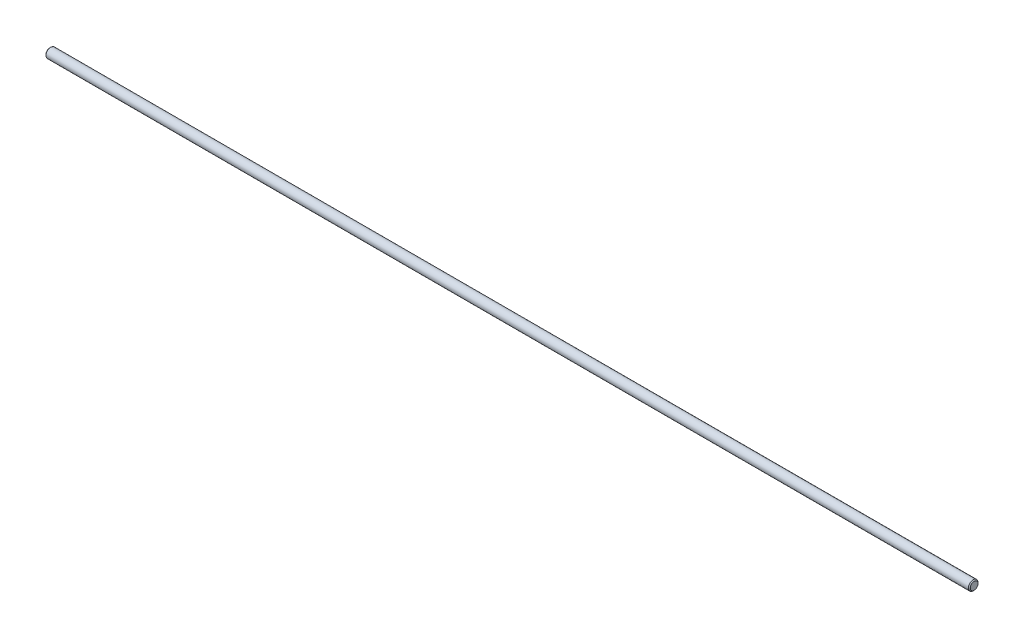
ISO-10303-21;
HEADER;
FILE_DESCRIPTION(('STEP AP214'),'2;1');
FILE_NAME('part.step','',(''),(''),'','','');
FILE_SCHEMA(('AUTOMOTIVE_DESIGN { 1 0 10303 214 1 1 1 1 }'));
ENDSEC;
DATA;
#1=APPLICATION_CONTEXT('core data for automotive mechanical design processes');
#2=APPLICATION_PROTOCOL_DEFINITION('international standard','automotive_design',2000,#1);
#3=PRODUCT_CONTEXT('',#1,'mechanical');
#4=PRODUCT('Part','Part','',(#3));
#5=PRODUCT_RELATED_PRODUCT_CATEGORY('part','',(#4));
#6=PRODUCT_DEFINITION_FORMATION('','',#4);
#7=PRODUCT_DEFINITION_CONTEXT('part definition',#1,'design');
#8=PRODUCT_DEFINITION('design','',#6,#7);
#9=PRODUCT_DEFINITION_SHAPE('','',#8);
#10=(LENGTH_UNIT() NAMED_UNIT(*) SI_UNIT(.MILLI.,.METRE.));
#11=(NAMED_UNIT(*) PLANE_ANGLE_UNIT() SI_UNIT($,.RADIAN.));
#12=(NAMED_UNIT(*) SI_UNIT($,.STERADIAN.) SOLID_ANGLE_UNIT());
#13=UNCERTAINTY_MEASURE_WITH_UNIT(LENGTH_MEASURE(1.E-05),#10,'distance_accuracy_value','');
#14=(GEOMETRIC_REPRESENTATION_CONTEXT(3) GLOBAL_UNCERTAINTY_ASSIGNED_CONTEXT((#13)) GLOBAL_UNIT_ASSIGNED_CONTEXT((#10,
#11,#12)) REPRESENTATION_CONTEXT('',''));
#15=CARTESIAN_POINT('',(0.,0.,0.));
#16=DIRECTION('',(0.,0.,1.));
#17=DIRECTION('',(1.,0.,0.));
#18=AXIS2_PLACEMENT_3D('',#15,#16,#17);
#19=CARTESIAN_POINT('',(-304.8,0.,0.));
#20=DIRECTION('',(1.,0.,0.));
#21=DIRECTION('',(0.,0.,-1.));
#22=AXIS2_PLACEMENT_3D('',#19,#20,#21);
#23=CYLINDRICAL_SURFACE('',#22,3.175);
#24=CARTESIAN_POINT('',(304.165,0.,0.));
#25=DIRECTION('',(1.,0.,0.));
#26=DIRECTION('',(0.,0.,-1.));
#27=AXIS2_PLACEMENT_3D('',#24,#25,#26);
#28=CIRCLE('',#27,3.175);
#29=CARTESIAN_POINT('',(304.165,0.,-3.175));
#30=VERTEX_POINT('',#29);
#31=EDGE_CURVE('E36',#30,#30,#28,.F.);
#32=ORIENTED_EDGE('',*,*,#31,.T.);
#33=EDGE_LOOP('',(#32));
#34=FACE_BOUND('',#33,.T.);
#35=CARTESIAN_POINT('',(-304.165,0.,0.));
#36=DIRECTION('',(1.,0.,0.));
#37=DIRECTION('',(0.,0.,-1.));
#38=AXIS2_PLACEMENT_3D('',#35,#36,#37);
#39=CIRCLE('',#38,3.175);
#40=CARTESIAN_POINT('',(-304.165,0.,-3.175));
#41=VERTEX_POINT('',#40);
#42=EDGE_CURVE('E40',#41,#41,#39,.T.);
#43=ORIENTED_EDGE('',*,*,#42,.T.);
#44=EDGE_LOOP('',(#43));
#45=FACE_BOUND('',#44,.T.);
#46=ADVANCED_FACE('F29',(#34,#45),#23,.T.);
#47=CARTESIAN_POINT('',(-304.8,0.,0.));
#48=DIRECTION('',(1.,0.,0.));
#49=DIRECTION('',(0.,0.,-1.));
#50=AXIS2_PLACEMENT_3D('',#47,#48,#49);
#51=PLANE('',#50);
#52=CARTESIAN_POINT('',(-304.8,0.,0.));
#53=DIRECTION('',(1.,0.,0.));
#54=DIRECTION('',(0.,0.,-1.));
#55=AXIS2_PLACEMENT_3D('',#52,#53,#54);
#56=CIRCLE('',#55,2.53999999999993);
#57=CARTESIAN_POINT('',(-304.8,0.,-2.53999999999993));
#58=VERTEX_POINT('',#57);
#59=EDGE_CURVE('E10',#58,#58,#56,.F.);
#60=ORIENTED_EDGE('',*,*,#59,.T.);
#61=EDGE_LOOP('',(#60));
#62=FACE_BOUND('',#61,.T.);
#63=ADVANCED_FACE('F60',(#62),#51,.F.);
#64=CARTESIAN_POINT('',(304.8,0.,0.));
#65=DIRECTION('',(1.,0.,0.));
#66=DIRECTION('',(0.,0.,-1.));
#67=AXIS2_PLACEMENT_3D('',#64,#65,#66);
#68=PLANE('',#67);
#69=CARTESIAN_POINT('',(304.8,0.,0.));
#70=DIRECTION('',(1.,0.,0.));
#71=DIRECTION('',(0.,0.,-1.));
#72=AXIS2_PLACEMENT_3D('',#69,#70,#71);
#73=CIRCLE('',#72,2.53999999999993);
#74=CARTESIAN_POINT('',(304.8,0.,-2.53999999999993));
#75=VERTEX_POINT('',#74);
#76=EDGE_CURVE('E44',#75,#75,#73,.T.);
#77=ORIENTED_EDGE('',*,*,#76,.T.);
#78=EDGE_LOOP('',(#77));
#79=FACE_BOUND('',#78,.T.);
#80=ADVANCED_FACE('F50',(#79),#68,.T.);
#81=CARTESIAN_POINT('',(304.8,0.,0.));
#82=DIRECTION('',(-1.,0.,0.));
#83=DIRECTION('',(0.,0.,1.));
#84=AXIS2_PLACEMENT_3D('',#81,#82,#83);
#85=CONICAL_SURFACE('',#84,2.53999999999993,0.785398163397375);
#86=ORIENTED_EDGE('',*,*,#31,.F.);
#87=EDGE_LOOP('',(#86));
#88=FACE_BOUND('',#87,.T.);
#89=ORIENTED_EDGE('',*,*,#76,.F.);
#90=EDGE_LOOP('',(#89));
#91=FACE_BOUND('',#90,.T.);
#92=ADVANCED_FACE('F52',(#88,#91),#85,.T.);
#93=CARTESIAN_POINT('',(-304.165,0.,0.));
#94=DIRECTION('',(1.,0.,0.));
#95=DIRECTION('',(0.,0.,-1.));
#96=AXIS2_PLACEMENT_3D('',#93,#94,#95);
#97=CONICAL_SURFACE('',#96,3.175,0.785398163397418);
#98=ORIENTED_EDGE('',*,*,#59,.F.);
#99=EDGE_LOOP('',(#98));
#100=FACE_BOUND('',#99,.T.);
#101=ORIENTED_EDGE('',*,*,#42,.F.);
#102=EDGE_LOOP('',(#101));
#103=FACE_BOUND('',#102,.T.);
#104=ADVANCED_FACE('F31',(#100,#103),#97,.T.);
#105=CLOSED_SHELL('',(#46,#63,#80,#92,#104));
#106=MANIFOLD_SOLID_BREP('B2',#105);
#107=ADVANCED_BREP_SHAPE_REPRESENTATION('',(#18,#106),#14);
#108=SHAPE_DEFINITION_REPRESENTATION(#9,#107);
ENDSEC;
END-ISO-10303-21;
